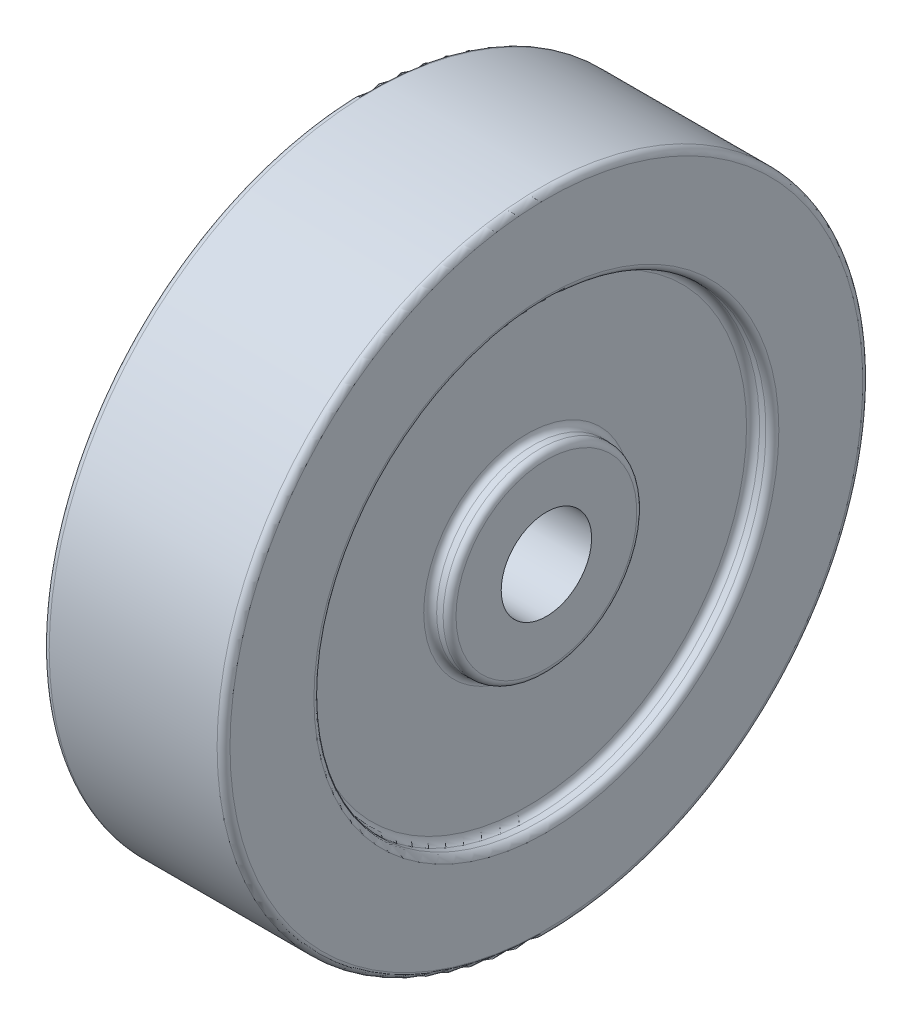
ISO-10303-21;
HEADER;
FILE_DESCRIPTION(('STEP AP214'),'2;1');
FILE_NAME('part.step','',(''),(''),'','','');
FILE_SCHEMA(('AUTOMOTIVE_DESIGN { 1 0 10303 214 1 1 1 1 }'));
ENDSEC;
DATA;
#1=APPLICATION_CONTEXT('core data for automotive mechanical design processes');
#2=APPLICATION_PROTOCOL_DEFINITION('international standard','automotive_design',2000,#1);
#3=PRODUCT_CONTEXT('',#1,'mechanical');
#4=PRODUCT('Part','Part','',(#3));
#5=PRODUCT_RELATED_PRODUCT_CATEGORY('part','',(#4));
#6=PRODUCT_DEFINITION_FORMATION('','',#4);
#7=PRODUCT_DEFINITION_CONTEXT('part definition',#1,'design');
#8=PRODUCT_DEFINITION('design','',#6,#7);
#9=PRODUCT_DEFINITION_SHAPE('','',#8);
#10=(LENGTH_UNIT() NAMED_UNIT(*) SI_UNIT(.MILLI.,.METRE.));
#11=(NAMED_UNIT(*) PLANE_ANGLE_UNIT() SI_UNIT($,.RADIAN.));
#12=(NAMED_UNIT(*) SI_UNIT($,.STERADIAN.) SOLID_ANGLE_UNIT());
#13=UNCERTAINTY_MEASURE_WITH_UNIT(LENGTH_MEASURE(1.E-05),#10,'distance_accuracy_value','');
#14=(GEOMETRIC_REPRESENTATION_CONTEXT(3) GLOBAL_UNCERTAINTY_ASSIGNED_CONTEXT((#13)) GLOBAL_UNIT_ASSIGNED_CONTEXT((#10,
#11,#12)) REPRESENTATION_CONTEXT('',''));
#15=CARTESIAN_POINT('',(0.,0.,0.));
#16=DIRECTION('',(0.,0.,1.));
#17=DIRECTION('',(1.,0.,0.));
#18=AXIS2_PLACEMENT_3D('',#15,#16,#17);
#19=CARTESIAN_POINT('',(-90.0722891566265,0.,0.));
#20=DIRECTION('',(-1.,0.,0.));
#21=DIRECTION('',(0.,0.,1.));
#22=AXIS2_PLACEMENT_3D('',#19,#20,#21);
#23=CYLINDRICAL_SURFACE('',#22,7.);
#24=CARTESIAN_POINT('',(14.,0.,0.));
#25=DIRECTION('',(-1.,0.,0.));
#26=DIRECTION('',(0.,0.,1.));
#27=AXIS2_PLACEMENT_3D('',#24,#25,#26);
#28=CIRCLE('',#27,7.);
#29=CARTESIAN_POINT('',(14.,0.,7.));
#30=VERTEX_POINT('',#29);
#31=EDGE_CURVE('E106',#30,#30,#28,.T.);
#32=ORIENTED_EDGE('',*,*,#31,.F.);
#33=EDGE_LOOP('',(#32));
#34=FACE_BOUND('',#33,.T.);
#35=CARTESIAN_POINT('',(-14.,0.,0.));
#36=DIRECTION('',(-1.,0.,0.));
#37=DIRECTION('',(0.,0.,1.));
#38=AXIS2_PLACEMENT_3D('',#35,#36,#37);
#39=CIRCLE('',#38,7.);
#40=CARTESIAN_POINT('',(-14.,0.,7.));
#41=VERTEX_POINT('',#40);
#42=EDGE_CURVE('E109',#41,#41,#39,.T.);
#43=ORIENTED_EDGE('',*,*,#42,.T.);
#44=EDGE_LOOP('',(#43));
#45=FACE_BOUND('',#44,.T.);
#46=ADVANCED_FACE('F38',(#34,#45),#23,.F.);
#47=CARTESIAN_POINT('',(14.,7.,0.));
#48=DIRECTION('',(-1.,0.,0.));
#49=DIRECTION('',(0.,0.,1.));
#50=AXIS2_PLACEMENT_3D('',#47,#48,#49);
#51=PLANE('',#50);
#52=CARTESIAN_POINT('',(14.,0.,0.));
#53=DIRECTION('',(-1.,0.,0.));
#54=DIRECTION('',(0.,0.,1.));
#55=AXIS2_PLACEMENT_3D('',#52,#53,#54);
#56=CIRCLE('',#55,14.);
#57=CARTESIAN_POINT('',(14.,0.,14.));
#58=VERTEX_POINT('',#57);
#59=EDGE_CURVE('E70',#58,#58,#56,.F.);
#60=ORIENTED_EDGE('',*,*,#59,.T.);
#61=EDGE_LOOP('',(#60));
#62=FACE_BOUND('',#61,.T.);
#63=ORIENTED_EDGE('',*,*,#31,.T.);
#64=EDGE_LOOP('',(#63));
#65=FACE_BOUND('',#64,.T.);
#66=ADVANCED_FACE('F131',(#62,#65),#51,.F.);
#67=CARTESIAN_POINT('',(-90.0722891566265,0.,0.));
#68=DIRECTION('',(-1.,0.,0.));
#69=DIRECTION('',(0.,0.,1.));
#70=AXIS2_PLACEMENT_3D('',#67,#68,#69);
#71=CYLINDRICAL_SURFACE('',#70,15.);
#72=CARTESIAN_POINT('',(13.,0.,0.));
#73=DIRECTION('',(-1.,0.,0.));
#74=DIRECTION('',(0.,0.,1.));
#75=AXIS2_PLACEMENT_3D('',#72,#73,#74);
#76=CIRCLE('',#75,15.);
#77=CARTESIAN_POINT('',(13.,0.,15.));
#78=VERTEX_POINT('',#77);
#79=EDGE_CURVE('E73',#78,#78,#76,.T.);
#80=ORIENTED_EDGE('',*,*,#79,.T.);
#81=EDGE_LOOP('',(#80));
#82=FACE_BOUND('',#81,.T.);
#83=CARTESIAN_POINT('',(12.,0.,0.));
#84=DIRECTION('',(-1.,0.,0.));
#85=DIRECTION('',(0.,0.,1.));
#86=AXIS2_PLACEMENT_3D('',#83,#84,#85);
#87=CIRCLE('',#86,15.);
#88=CARTESIAN_POINT('',(12.,0.,15.));
#89=VERTEX_POINT('',#88);
#90=EDGE_CURVE('E76',#89,#89,#87,.F.);
#91=ORIENTED_EDGE('',*,*,#90,.T.);
#92=EDGE_LOOP('',(#91));
#93=FACE_BOUND('',#92,.T.);
#94=ADVANCED_FACE('F137',(#82,#93),#71,.T.);
#95=CARTESIAN_POINT('',(11.,15.,0.));
#96=DIRECTION('',(-1.,0.,0.));
#97=DIRECTION('',(0.,0.,1.));
#98=AXIS2_PLACEMENT_3D('',#95,#96,#97);
#99=PLANE('',#98);
#100=CARTESIAN_POINT('',(11.,0.,0.));
#101=DIRECTION('',(-1.,0.,0.));
#102=DIRECTION('',(0.,0.,1.));
#103=AXIS2_PLACEMENT_3D('',#100,#101,#102);
#104=CIRCLE('',#103,16.);
#105=CARTESIAN_POINT('',(11.,0.,16.));
#106=VERTEX_POINT('',#105);
#107=EDGE_CURVE('E64',#106,#106,#104,.T.);
#108=ORIENTED_EDGE('',*,*,#107,.T.);
#109=EDGE_LOOP('',(#108));
#110=FACE_BOUND('',#109,.T.);
#111=CARTESIAN_POINT('',(11.,0.,0.));
#112=DIRECTION('',(-1.,0.,0.));
#113=DIRECTION('',(0.,0.,1.));
#114=AXIS2_PLACEMENT_3D('',#111,#112,#113);
#115=CIRCLE('',#114,34.);
#116=CARTESIAN_POINT('',(11.,0.,34.));
#117=VERTEX_POINT('',#116);
#118=EDGE_CURVE('E67',#117,#117,#115,.F.);
#119=ORIENTED_EDGE('',*,*,#118,.T.);
#120=EDGE_LOOP('',(#119));
#121=FACE_BOUND('',#120,.T.);
#122=ADVANCED_FACE('F191',(#110,#121),#99,.F.);
#123=CARTESIAN_POINT('',(-90.0722891566265,0.,0.));
#124=DIRECTION('',(-1.,0.,0.));
#125=DIRECTION('',(0.,0.,1.));
#126=AXIS2_PLACEMENT_3D('',#123,#124,#125);
#127=CYLINDRICAL_SURFACE('',#126,35.);
#128=CARTESIAN_POINT('',(12.,0.,0.));
#129=DIRECTION('',(-1.,0.,0.));
#130=DIRECTION('',(0.,0.,1.));
#131=AXIS2_PLACEMENT_3D('',#128,#129,#130);
#132=CIRCLE('',#131,35.);
#133=CARTESIAN_POINT('',(12.,0.,35.));
#134=VERTEX_POINT('',#133);
#135=EDGE_CURVE('E58',#134,#134,#132,.T.);
#136=ORIENTED_EDGE('',*,*,#135,.T.);
#137=EDGE_LOOP('',(#136));
#138=FACE_BOUND('',#137,.T.);
#139=CARTESIAN_POINT('',(13.,0.,0.));
#140=DIRECTION('',(-1.,0.,0.));
#141=DIRECTION('',(0.,0.,1.));
#142=AXIS2_PLACEMENT_3D('',#139,#140,#141);
#143=CIRCLE('',#142,35.);
#144=CARTESIAN_POINT('',(13.,0.,35.));
#145=VERTEX_POINT('',#144);
#146=EDGE_CURVE('E61',#145,#145,#143,.F.);
#147=ORIENTED_EDGE('',*,*,#146,.T.);
#148=EDGE_LOOP('',(#147));
#149=FACE_BOUND('',#148,.T.);
#150=ADVANCED_FACE('F182',(#138,#149),#127,.F.);
#151=CARTESIAN_POINT('',(14.,35.,0.));
#152=DIRECTION('',(-1.,0.,0.));
#153=DIRECTION('',(0.,0.,1.));
#154=AXIS2_PLACEMENT_3D('',#151,#152,#153);
#155=PLANE('',#154);
#156=CARTESIAN_POINT('',(14.,0.,0.));
#157=DIRECTION('',(-1.,0.,0.));
#158=DIRECTION('',(0.,0.,1.));
#159=AXIS2_PLACEMENT_3D('',#156,#157,#158);
#160=CIRCLE('',#159,36.);
#161=CARTESIAN_POINT('',(14.,0.,36.));
#162=VERTEX_POINT('',#161);
#163=EDGE_CURVE('E49',#162,#162,#160,.T.);
#164=ORIENTED_EDGE('',*,*,#163,.T.);
#165=EDGE_LOOP('',(#164));
#166=FACE_BOUND('',#165,.T.);
#167=CARTESIAN_POINT('',(14.,0.,0.));
#168=DIRECTION('',(-1.,0.,0.));
#169=DIRECTION('',(0.,0.,1.));
#170=AXIS2_PLACEMENT_3D('',#167,#168,#169);
#171=CIRCLE('',#170,49.);
#172=CARTESIAN_POINT('',(14.,0.,49.));
#173=VERTEX_POINT('',#172);
#174=EDGE_CURVE('E53',#173,#173,#171,.F.);
#175=ORIENTED_EDGE('',*,*,#174,.T.);
#176=EDGE_LOOP('',(#175));
#177=FACE_BOUND('',#176,.T.);
#178=ADVANCED_FACE('F179',(#166,#177),#155,.F.);
#179=CARTESIAN_POINT('',(-90.0722891566265,0.,0.));
#180=DIRECTION('',(-1.,0.,0.));
#181=DIRECTION('',(0.,0.,1.));
#182=AXIS2_PLACEMENT_3D('',#179,#180,#181);
#183=CYLINDRICAL_SURFACE('',#182,50.);
#184=CARTESIAN_POINT('',(13.,0.,0.));
#185=DIRECTION('',(-1.,0.,0.));
#186=DIRECTION('',(0.,0.,1.));
#187=AXIS2_PLACEMENT_3D('',#184,#185,#186);
#188=CIRCLE('',#187,50.);
#189=CARTESIAN_POINT('',(13.,0.,50.));
#190=VERTEX_POINT('',#189);
#191=EDGE_CURVE('E10',#190,#190,#188,.T.);
#192=ORIENTED_EDGE('',*,*,#191,.T.);
#193=EDGE_LOOP('',(#192));
#194=FACE_BOUND('',#193,.T.);
#195=CARTESIAN_POINT('',(-13.,0.,0.));
#196=DIRECTION('',(1.,0.,0.));
#197=DIRECTION('',(0.,0.,-1.));
#198=AXIS2_PLACEMENT_3D('',#195,#196,#197);
#199=CIRCLE('',#198,50.);
#200=CARTESIAN_POINT('',(-13.,0.,-50.));
#201=VERTEX_POINT('',#200);
#202=EDGE_CURVE('E45',#201,#201,#199,.T.);
#203=ORIENTED_EDGE('',*,*,#202,.T.);
#204=EDGE_LOOP('',(#203));
#205=FACE_BOUND('',#204,.T.);
#206=ADVANCED_FACE('F181',(#194,#205),#183,.T.);
#207=CARTESIAN_POINT('',(-14.,35.,0.));
#208=DIRECTION('',(1.,0.,0.));
#209=DIRECTION('',(0.,0.,-1.));
#210=AXIS2_PLACEMENT_3D('',#207,#208,#209);
#211=PLANE('',#210);
#212=CARTESIAN_POINT('',(-14.,0.,0.));
#213=DIRECTION('',(1.,0.,0.));
#214=DIRECTION('',(0.,0.,-1.));
#215=AXIS2_PLACEMENT_3D('',#212,#213,#214);
#216=CIRCLE('',#215,36.);
#217=CARTESIAN_POINT('',(-14.,0.,-36.));
#218=VERTEX_POINT('',#217);
#219=EDGE_CURVE('E79',#218,#218,#216,.T.);
#220=ORIENTED_EDGE('',*,*,#219,.T.);
#221=EDGE_LOOP('',(#220));
#222=FACE_BOUND('',#221,.T.);
#223=CARTESIAN_POINT('',(-14.,0.,0.));
#224=DIRECTION('',(1.,0.,0.));
#225=DIRECTION('',(0.,0.,-1.));
#226=AXIS2_PLACEMENT_3D('',#223,#224,#225);
#227=CIRCLE('',#226,49.);
#228=CARTESIAN_POINT('',(-14.,0.,-49.));
#229=VERTEX_POINT('',#228);
#230=EDGE_CURVE('E82',#229,#229,#227,.F.);
#231=ORIENTED_EDGE('',*,*,#230,.T.);
#232=EDGE_LOOP('',(#231));
#233=FACE_BOUND('',#232,.T.);
#234=ADVANCED_FACE('F189',(#222,#233),#211,.F.);
#235=CARTESIAN_POINT('',(-90.0722891566265,0.,0.));
#236=DIRECTION('',(-1.,0.,0.));
#237=DIRECTION('',(0.,0.,1.));
#238=AXIS2_PLACEMENT_3D('',#235,#236,#237);
#239=CYLINDRICAL_SURFACE('',#238,35.);
#240=CARTESIAN_POINT('',(-12.,0.,0.));
#241=DIRECTION('',(1.,0.,0.));
#242=DIRECTION('',(0.,0.,-1.));
#243=AXIS2_PLACEMENT_3D('',#240,#241,#242);
#244=CIRCLE('',#243,35.);
#245=CARTESIAN_POINT('',(-12.,0.,-35.));
#246=VERTEX_POINT('',#245);
#247=EDGE_CURVE('E85',#246,#246,#244,.T.);
#248=ORIENTED_EDGE('',*,*,#247,.T.);
#249=EDGE_LOOP('',(#248));
#250=FACE_BOUND('',#249,.T.);
#251=CARTESIAN_POINT('',(-13.,0.,0.));
#252=DIRECTION('',(1.,0.,0.));
#253=DIRECTION('',(0.,0.,-1.));
#254=AXIS2_PLACEMENT_3D('',#251,#252,#253);
#255=CIRCLE('',#254,35.);
#256=CARTESIAN_POINT('',(-13.,0.,-35.));
#257=VERTEX_POINT('',#256);
#258=EDGE_CURVE('E88',#257,#257,#255,.F.);
#259=ORIENTED_EDGE('',*,*,#258,.T.);
#260=EDGE_LOOP('',(#259));
#261=FACE_BOUND('',#260,.T.);
#262=ADVANCED_FACE('F251',(#250,#261),#239,.F.);
#263=CARTESIAN_POINT('',(-11.,15.,0.));
#264=DIRECTION('',(1.,0.,0.));
#265=DIRECTION('',(0.,0.,-1.));
#266=AXIS2_PLACEMENT_3D('',#263,#264,#265);
#267=PLANE('',#266);
#268=CARTESIAN_POINT('',(-11.,0.,0.));
#269=DIRECTION('',(1.,0.,0.));
#270=DIRECTION('',(0.,0.,-1.));
#271=AXIS2_PLACEMENT_3D('',#268,#269,#270);
#272=CIRCLE('',#271,34.);
#273=CARTESIAN_POINT('',(-11.,0.,-34.));
#274=VERTEX_POINT('',#273);
#275=EDGE_CURVE('E91',#274,#274,#272,.F.);
#276=ORIENTED_EDGE('',*,*,#275,.T.);
#277=EDGE_LOOP('',(#276));
#278=FACE_BOUND('',#277,.T.);
#279=CARTESIAN_POINT('',(-11.,0.,0.));
#280=DIRECTION('',(1.,0.,0.));
#281=DIRECTION('',(0.,0.,-1.));
#282=AXIS2_PLACEMENT_3D('',#279,#280,#281);
#283=CIRCLE('',#282,16.);
#284=CARTESIAN_POINT('',(-11.,0.,-16.));
#285=VERTEX_POINT('',#284);
#286=EDGE_CURVE('E94',#285,#285,#283,.T.);
#287=ORIENTED_EDGE('',*,*,#286,.T.);
#288=EDGE_LOOP('',(#287));
#289=FACE_BOUND('',#288,.T.);
#290=ADVANCED_FACE('F127',(#278,#289),#267,.F.);
#291=CARTESIAN_POINT('',(-90.0722891566265,0.,0.));
#292=DIRECTION('',(-1.,0.,0.));
#293=DIRECTION('',(0.,0.,1.));
#294=AXIS2_PLACEMENT_3D('',#291,#292,#293);
#295=CYLINDRICAL_SURFACE('',#294,15.);
#296=CARTESIAN_POINT('',(-13.,0.,0.));
#297=DIRECTION('',(1.,0.,0.));
#298=DIRECTION('',(0.,0.,-1.));
#299=AXIS2_PLACEMENT_3D('',#296,#297,#298);
#300=CIRCLE('',#299,15.);
#301=CARTESIAN_POINT('',(-13.,0.,-15.));
#302=VERTEX_POINT('',#301);
#303=EDGE_CURVE('E97',#302,#302,#300,.T.);
#304=ORIENTED_EDGE('',*,*,#303,.T.);
#305=EDGE_LOOP('',(#304));
#306=FACE_BOUND('',#305,.T.);
#307=CARTESIAN_POINT('',(-12.,0.,0.));
#308=DIRECTION('',(1.,0.,0.));
#309=DIRECTION('',(0.,0.,-1.));
#310=AXIS2_PLACEMENT_3D('',#307,#308,#309);
#311=CIRCLE('',#310,15.);
#312=CARTESIAN_POINT('',(-12.,0.,-15.));
#313=VERTEX_POINT('',#312);
#314=EDGE_CURVE('E100',#313,#313,#311,.F.);
#315=ORIENTED_EDGE('',*,*,#314,.T.);
#316=EDGE_LOOP('',(#315));
#317=FACE_BOUND('',#316,.T.);
#318=ADVANCED_FACE('F117',(#306,#317),#295,.T.);
#319=CARTESIAN_POINT('',(-14.,7.,0.));
#320=DIRECTION('',(1.,0.,0.));
#321=DIRECTION('',(0.,0.,-1.));
#322=AXIS2_PLACEMENT_3D('',#319,#320,#321);
#323=PLANE('',#322);
#324=CARTESIAN_POINT('',(-14.,0.,0.));
#325=DIRECTION('',(1.,0.,0.));
#326=DIRECTION('',(0.,0.,-1.));
#327=AXIS2_PLACEMENT_3D('',#324,#325,#326);
#328=CIRCLE('',#327,14.);
#329=CARTESIAN_POINT('',(-14.,0.,-14.));
#330=VERTEX_POINT('',#329);
#331=EDGE_CURVE('E103',#330,#330,#328,.F.);
#332=ORIENTED_EDGE('',*,*,#331,.T.);
#333=EDGE_LOOP('',(#332));
#334=FACE_BOUND('',#333,.T.);
#335=ORIENTED_EDGE('',*,*,#42,.F.);
#336=EDGE_LOOP('',(#335));
#337=FACE_BOUND('',#336,.T.);
#338=ADVANCED_FACE('F114',(#334,#337),#323,.F.);
#339=CARTESIAN_POINT('',(-13.,0.,0.));
#340=DIRECTION('',(1.,0.,0.));
#341=DIRECTION('',(0.,0.,-1.));
#342=AXIS2_PLACEMENT_3D('',#339,#340,#341);
#343=TOROIDAL_SURFACE('',#342,14.,1.);
#344=ORIENTED_EDGE('',*,*,#303,.F.);
#345=EDGE_LOOP('',(#344));
#346=FACE_BOUND('',#345,.T.);
#347=ORIENTED_EDGE('',*,*,#331,.F.);
#348=EDGE_LOOP('',(#347));
#349=FACE_BOUND('',#348,.T.);
#350=ADVANCED_FACE('F116',(#346,#349),#343,.T.);
#351=CARTESIAN_POINT('',(-12.,0.,0.));
#352=DIRECTION('',(1.,0.,0.));
#353=DIRECTION('',(0.,0.,-1.));
#354=AXIS2_PLACEMENT_3D('',#351,#352,#353);
#355=TOROIDAL_SURFACE('',#354,34.,1.);
#356=ORIENTED_EDGE('',*,*,#247,.F.);
#357=EDGE_LOOP('',(#356));
#358=FACE_BOUND('',#357,.T.);
#359=ORIENTED_EDGE('',*,*,#275,.F.);
#360=EDGE_LOOP('',(#359));
#361=FACE_BOUND('',#360,.T.);
#362=ADVANCED_FACE('F124',(#358,#361),#355,.F.);
#363=CARTESIAN_POINT('',(-12.,0.,0.));
#364=DIRECTION('',(1.,0.,0.));
#365=DIRECTION('',(0.,0.,-1.));
#366=AXIS2_PLACEMENT_3D('',#363,#364,#365);
#367=TOROIDAL_SURFACE('',#366,16.,1.);
#368=ORIENTED_EDGE('',*,*,#286,.F.);
#369=EDGE_LOOP('',(#368));
#370=FACE_BOUND('',#369,.T.);
#371=ORIENTED_EDGE('',*,*,#314,.F.);
#372=EDGE_LOOP('',(#371));
#373=FACE_BOUND('',#372,.T.);
#374=ADVANCED_FACE('F145',(#370,#373),#367,.F.);
#375=CARTESIAN_POINT('',(-13.,0.,0.));
#376=DIRECTION('',(1.,0.,0.));
#377=DIRECTION('',(0.,0.,-1.));
#378=AXIS2_PLACEMENT_3D('',#375,#376,#377);
#379=TOROIDAL_SURFACE('',#378,36.,1.);
#380=ORIENTED_EDGE('',*,*,#219,.F.);
#381=EDGE_LOOP('',(#380));
#382=FACE_BOUND('',#381,.T.);
#383=ORIENTED_EDGE('',*,*,#258,.F.);
#384=EDGE_LOOP('',(#383));
#385=FACE_BOUND('',#384,.T.);
#386=ADVANCED_FACE('F149',(#382,#385),#379,.T.);
#387=CARTESIAN_POINT('',(13.,0.,0.));
#388=DIRECTION('',(-1.,0.,0.));
#389=DIRECTION('',(0.,0.,1.));
#390=AXIS2_PLACEMENT_3D('',#387,#388,#389);
#391=TOROIDAL_SURFACE('',#390,14.,1.);
#392=ORIENTED_EDGE('',*,*,#59,.F.);
#393=EDGE_LOOP('',(#392));
#394=FACE_BOUND('',#393,.T.);
#395=ORIENTED_EDGE('',*,*,#79,.F.);
#396=EDGE_LOOP('',(#395));
#397=FACE_BOUND('',#396,.T.);
#398=ADVANCED_FACE('F153',(#394,#397),#391,.T.);
#399=CARTESIAN_POINT('',(12.,0.,0.));
#400=DIRECTION('',(-1.,0.,0.));
#401=DIRECTION('',(0.,0.,1.));
#402=AXIS2_PLACEMENT_3D('',#399,#400,#401);
#403=TOROIDAL_SURFACE('',#402,16.,1.);
#404=ORIENTED_EDGE('',*,*,#90,.F.);
#405=EDGE_LOOP('',(#404));
#406=FACE_BOUND('',#405,.T.);
#407=ORIENTED_EDGE('',*,*,#107,.F.);
#408=EDGE_LOOP('',(#407));
#409=FACE_BOUND('',#408,.T.);
#410=ADVANCED_FACE('F157',(#406,#409),#403,.F.);
#411=CARTESIAN_POINT('',(12.,0.,0.));
#412=DIRECTION('',(-1.,0.,0.));
#413=DIRECTION('',(0.,0.,1.));
#414=AXIS2_PLACEMENT_3D('',#411,#412,#413);
#415=TOROIDAL_SURFACE('',#414,34.,1.);
#416=ORIENTED_EDGE('',*,*,#118,.F.);
#417=EDGE_LOOP('',(#416));
#418=FACE_BOUND('',#417,.T.);
#419=ORIENTED_EDGE('',*,*,#135,.F.);
#420=EDGE_LOOP('',(#419));
#421=FACE_BOUND('',#420,.T.);
#422=ADVANCED_FACE('F161',(#418,#421),#415,.F.);
#423=CARTESIAN_POINT('',(13.,0.,0.));
#424=DIRECTION('',(-1.,0.,0.));
#425=DIRECTION('',(0.,0.,1.));
#426=AXIS2_PLACEMENT_3D('',#423,#424,#425);
#427=TOROIDAL_SURFACE('',#426,36.,1.);
#428=ORIENTED_EDGE('',*,*,#146,.F.);
#429=EDGE_LOOP('',(#428));
#430=FACE_BOUND('',#429,.T.);
#431=ORIENTED_EDGE('',*,*,#163,.F.);
#432=EDGE_LOOP('',(#431));
#433=FACE_BOUND('',#432,.T.);
#434=ADVANCED_FACE('F165',(#430,#433),#427,.T.);
#435=CARTESIAN_POINT('',(13.,0.,0.));
#436=DIRECTION('',(-1.,0.,0.));
#437=DIRECTION('',(0.,0.,1.));
#438=AXIS2_PLACEMENT_3D('',#435,#436,#437);
#439=TOROIDAL_SURFACE('',#438,49.,1.);
#440=ORIENTED_EDGE('',*,*,#174,.F.);
#441=EDGE_LOOP('',(#440));
#442=FACE_BOUND('',#441,.T.);
#443=ORIENTED_EDGE('',*,*,#191,.F.);
#444=EDGE_LOOP('',(#443));
#445=FACE_BOUND('',#444,.T.);
#446=ADVANCED_FACE('F168',(#442,#445),#439,.T.);
#447=CARTESIAN_POINT('',(-13.,0.,0.));
#448=DIRECTION('',(1.,0.,0.));
#449=DIRECTION('',(0.,0.,-1.));
#450=AXIS2_PLACEMENT_3D('',#447,#448,#449);
#451=TOROIDAL_SURFACE('',#450,49.,1.);
#452=ORIENTED_EDGE('',*,*,#202,.F.);
#453=EDGE_LOOP('',(#452));
#454=FACE_BOUND('',#453,.T.);
#455=ORIENTED_EDGE('',*,*,#230,.F.);
#456=EDGE_LOOP('',(#455));
#457=FACE_BOUND('',#456,.T.);
#458=ADVANCED_FACE('F40',(#454,#457),#451,.T.);
#459=CLOSED_SHELL('',(#46,#66,#94,#122,#150,#178,#206,#234,#262,#290,#318,#338,#350,#362,#374,
#386,#398,#410,#422,#434,#446,#458));
#460=MANIFOLD_SOLID_BREP('B2',#459);
#461=ADVANCED_BREP_SHAPE_REPRESENTATION('',(#18,#460),#14);
#462=SHAPE_DEFINITION_REPRESENTATION(#9,#461);
ENDSEC;
END-ISO-10303-21;
